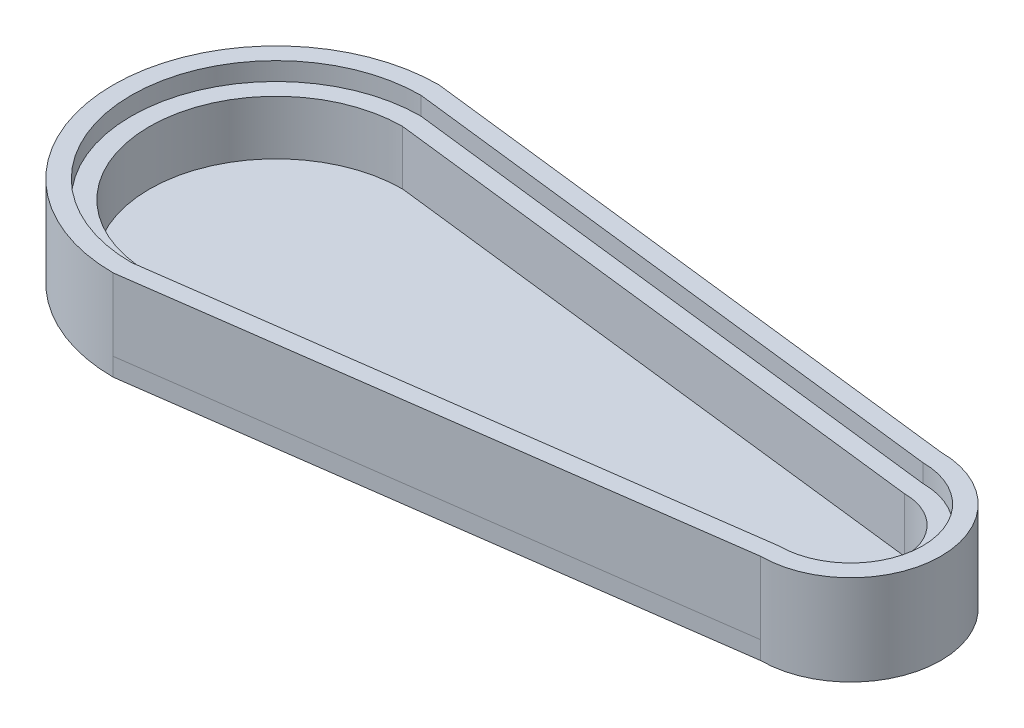
ISO-10303-21;
HEADER;
FILE_DESCRIPTION(('STEP AP214'),'2;1');
FILE_NAME('part.step','',(''),(''),'','','');
FILE_SCHEMA(('AUTOMOTIVE_DESIGN { 1 0 10303 214 1 1 1 1 }'));
ENDSEC;
DATA;
#1=APPLICATION_CONTEXT('core data for automotive mechanical design processes');
#2=APPLICATION_PROTOCOL_DEFINITION('international standard','automotive_design',2000,#1);
#3=PRODUCT_CONTEXT('',#1,'mechanical');
#4=PRODUCT('Part','Part','',(#3));
#5=PRODUCT_RELATED_PRODUCT_CATEGORY('part','',(#4));
#6=PRODUCT_DEFINITION_FORMATION('','',#4);
#7=PRODUCT_DEFINITION_CONTEXT('part definition',#1,'design');
#8=PRODUCT_DEFINITION('design','',#6,#7);
#9=PRODUCT_DEFINITION_SHAPE('','',#8);
#10=(LENGTH_UNIT() NAMED_UNIT(*) SI_UNIT(.MILLI.,.METRE.));
#11=(NAMED_UNIT(*) PLANE_ANGLE_UNIT() SI_UNIT($,.RADIAN.));
#12=(NAMED_UNIT(*) SI_UNIT($,.STERADIAN.) SOLID_ANGLE_UNIT());
#13=UNCERTAINTY_MEASURE_WITH_UNIT(LENGTH_MEASURE(1.E-05),#10,'distance_accuracy_value','');
#14=(GEOMETRIC_REPRESENTATION_CONTEXT(3) GLOBAL_UNCERTAINTY_ASSIGNED_CONTEXT((#13)) GLOBAL_UNIT_ASSIGNED_CONTEXT((#10,
#11,#12)) REPRESENTATION_CONTEXT('',''));
#15=CARTESIAN_POINT('',(0.,0.,0.));
#16=DIRECTION('',(0.,0.,1.));
#17=DIRECTION('',(1.,0.,0.));
#18=AXIS2_PLACEMENT_3D('',#15,#16,#17);
#19=CARTESIAN_POINT('',(0.,31.75,0.));
#20=DIRECTION('',(0.,1.,0.));
#21=DIRECTION('',(0.,0.,1.));
#22=AXIS2_PLACEMENT_3D('',#19,#20,#21);
#23=PLANE('',#22);
#24=CARTESIAN_POINT('',(0.,31.75,0.));
#25=DIRECTION('',(0.,1.,0.));
#26=DIRECTION('',(0.,0.,1.));
#27=AXIS2_PLACEMENT_3D('',#24,#25,#26);
#28=CIRCLE('',#27,57.2426593508019);
#29=CARTESIAN_POINT('',(0.000313664747946366,31.75,-57.2426593499425));
#30=VERTEX_POINT('',#29);
#31=CARTESIAN_POINT('',(-0.0015222865808856,31.75,57.2426593305604));
#32=VERTEX_POINT('',#31);
#33=EDGE_CURVE('E228',#30,#32,#28,.T.);
#34=ORIENTED_EDGE('',*,*,#33,.T.);
#35=DIRECTION('',(0.990671931885279,0.,-0.136268570751621));
#36=VECTOR('',#35,1.);
#37=CARTESIAN_POINT('',(-0.0015222865808856,31.75,57.2426593305604));
#38=LINE('',#37,#36);
#39=CARTESIAN_POINT('',(199.999555895984,31.75,29.7321786199013));
#40=VERTEX_POINT('',#39);
#41=EDGE_CURVE('E232',#32,#40,#38,.T.);
#42=ORIENTED_EDGE('',*,*,#41,.T.);
#43=CARTESIAN_POINT('',(199.999555895984,31.75,-1.96048073028239));
#44=DIRECTION('',(0.,1.,0.));
#45=DIRECTION('',(0.,0.,1.));
#46=AXIS2_PLACEMENT_3D('',#43,#44,#45);
#47=CIRCLE('',#46,31.6926593501836);
#48=CARTESIAN_POINT('',(199.999794405974,31.75,-33.6531400795686));
#49=VERTEX_POINT('',#48);
#50=EDGE_CURVE('E235',#40,#49,#47,.T.);
#51=ORIENTED_EDGE('',*,*,#50,.T.);
#52=DIRECTION('',(-0.993115890729855,0.,-0.117135936329746));
#53=VECTOR('',#52,1.);
#54=CARTESIAN_POINT('',(0.000313664747946366,31.75,-57.2426593499425));
#55=LINE('',#54,#53);
#56=EDGE_CURVE('E239',#49,#30,#55,.T.);
#57=ORIENTED_EDGE('',*,*,#56,.T.);
#58=EDGE_LOOP('',(#34,#42,#51,#57));
#59=FACE_BOUND('',#58,.T.);
#60=CARTESIAN_POINT('',(0.,31.75,0.));
#61=DIRECTION('',(0.,1.,0.));
#62=DIRECTION('',(0.,0.,1.));
#63=AXIS2_PLACEMENT_3D('',#60,#61,#62);
#64=CIRCLE('',#63,50.9);
#65=CARTESIAN_POINT('',(0.,31.75,-50.9));
#66=VERTEX_POINT('',#65);
#67=CARTESIAN_POINT('',(0.,31.75,50.9));
#68=VERTEX_POINT('',#67);
#69=EDGE_CURVE('E150',#66,#68,#64,.T.);
#70=ORIENTED_EDGE('',*,*,#69,.F.);
#71=DIRECTION('',(0.993110118229267,0.,0.117184867071866));
#72=VECTOR('',#71,1.);
#73=CARTESIAN_POINT('',(0.,31.75,-50.9));
#74=LINE('',#73,#72);
#75=CARTESIAN_POINT('',(199.999555895984,31.75,-27.3004807302824));
#76=VERTEX_POINT('',#75);
#77=EDGE_CURVE('E61',#66,#76,#74,.T.);
#78=ORIENTED_EDGE('',*,*,#77,.T.);
#79=CARTESIAN_POINT('',(199.999555895984,31.75,-1.96048073028239));
#80=DIRECTION('',(0.,1.,0.));
#81=DIRECTION('',(0.,0.,1.));
#82=AXIS2_PLACEMENT_3D('',#79,#80,#81);
#83=CIRCLE('',#82,25.34);
#84=CARTESIAN_POINT('',(199.999555895984,31.75,23.3795192697176));
#85=VERTEX_POINT('',#84);
#86=EDGE_CURVE('E157',#85,#76,#83,.T.);
#87=ORIENTED_EDGE('',*,*,#86,.F.);
#88=DIRECTION('',(0.990665103732435,0.,-0.136318202184464));
#89=VECTOR('',#88,1.);
#90=CARTESIAN_POINT('',(0.,31.75,50.9));
#91=LINE('',#90,#89);
#92=EDGE_CURVE('E177',#68,#85,#91,.T.);
#93=ORIENTED_EDGE('',*,*,#92,.F.);
#94=EDGE_LOOP('',(#70,#78,#87,#93));
#95=FACE_BOUND('',#94,.T.);
#96=ADVANCED_FACE('F45',(#59,#95),#23,.T.);
#97=CARTESIAN_POINT('',(0.,6.35,0.));
#98=DIRECTION('',(0.,-1.,0.));
#99=DIRECTION('',(0.,0.,-1.));
#100=AXIS2_PLACEMENT_3D('',#97,#98,#99);
#101=CYLINDRICAL_SURFACE('',#100,57.2426593508019);
#102=CARTESIAN_POINT('',(0.,0.,0.));
#103=DIRECTION('',(0.,-1.,0.));
#104=DIRECTION('',(0.,0.,-1.));
#105=AXIS2_PLACEMENT_3D('',#102,#103,#104);
#106=CIRCLE('',#105,57.2426593508019);
#107=CARTESIAN_POINT('',(-0.0015222865808583,0.,57.2426593305604));
#108=VERTEX_POINT('',#107);
#109=CARTESIAN_POINT('',(0.000313664747946366,0.,-57.2426593499425));
#110=VERTEX_POINT('',#109);
#111=EDGE_CURVE('E325',#108,#110,#106,.T.);
#112=ORIENTED_EDGE('',*,*,#111,.F.);
#113=DIRECTION('',(0.,-1.,0.));
#114=VECTOR('',#113,1.);
#115=CARTESIAN_POINT('',(-0.0015222865808583,6.35,57.2426593305604));
#116=LINE('',#115,#114);
#117=CARTESIAN_POINT('',(-0.0015222865808856,6.35,57.2426593305604));
#118=VERTEX_POINT('',#117);
#119=EDGE_CURVE('E54',#118,#108,#116,.T.);
#120=ORIENTED_EDGE('',*,*,#119,.F.);
#121=DIRECTION('',(0.,-1.,0.));
#122=VECTOR('',#121,1.);
#123=CARTESIAN_POINT('',(-0.0015222865808856,31.75,57.2426593305604));
#124=LINE('',#123,#122);
#125=EDGE_CURVE('E254',#32,#118,#124,.T.);
#126=ORIENTED_EDGE('',*,*,#125,.F.);
#127=ORIENTED_EDGE('',*,*,#33,.F.);
#128=DIRECTION('',(0.,-1.,0.));
#129=VECTOR('',#128,1.);
#130=CARTESIAN_POINT('',(0.000313664747946366,6.35,-57.2426593499425));
#131=LINE('',#130,#129);
#132=EDGE_CURVE('E308',#30,#110,#131,.T.);
#133=ORIENTED_EDGE('',*,*,#132,.T.);
#134=EDGE_LOOP('',(#112,#120,#126,#127,#133));
#135=FACE_BOUND('',#134,.T.);
#136=ADVANCED_FACE('F47',(#135),#101,.T.);
#137=CARTESIAN_POINT('',(-0.0015222865808583,6.35,57.2426593305604));
#138=DIRECTION('',(-0.136268730244773,0.,-0.990671909946717));
#139=DIRECTION('',(-0.990671909946718,0.,0.136268730244773));
#140=AXIS2_PLACEMENT_3D('',#137,#138,#139);
#141=PLANE('',#140);
#142=DIRECTION('',(0.990671909946718,0.,-0.136268730244773));
#143=VECTOR('',#142,1.);
#144=CARTESIAN_POINT('',(-0.0015222865808583,0.,57.2426593305604));
#145=LINE('',#144,#143);
#146=CARTESIAN_POINT('',(199.999317385994,0.,29.7321786190038));
#147=VERTEX_POINT('',#146);
#148=EDGE_CURVE('E315',#108,#147,#145,.T.);
#149=ORIENTED_EDGE('',*,*,#148,.T.);
#150=DIRECTION('',(0.,-1.,0.));
#151=VECTOR('',#150,1.);
#152=CARTESIAN_POINT('',(199.999317385994,6.35,29.7321786190038));
#153=LINE('',#152,#151);
#154=CARTESIAN_POINT('',(199.999436640989,6.35,29.7321786194525));
#155=VERTEX_POINT('',#154);
#156=EDGE_CURVE('E296',#155,#147,#153,.T.);
#157=ORIENTED_EDGE('',*,*,#156,.F.);
#158=CARTESIAN_POINT('',(-0.0015222865808856,6.35,57.2426593305604));
#159=DIRECTION('',(0.990671931885279,0.,-0.136268570751621));
#160=VECTOR('',#159,1.);
#161=LINE('',#158,#160);
#162=EDGE_CURVE('E248',#118,#155,#161,.T.);
#163=ORIENTED_EDGE('',*,*,#162,.F.);
#164=ORIENTED_EDGE('',*,*,#119,.T.);
#165=EDGE_LOOP('',(#149,#157,#163,#164));
#166=FACE_BOUND('',#165,.T.);
#167=ADVANCED_FACE('F277',(#166),#141,.F.);
#168=CARTESIAN_POINT('',(199.999555895984,6.35,-1.96048073028239));
#169=DIRECTION('',(0.,-1.,0.));
#170=DIRECTION('',(0.,0.,-1.));
#171=AXIS2_PLACEMENT_3D('',#168,#169,#170);
#172=CYLINDRICAL_SURFACE('',#171,31.6926593501836);
#173=CARTESIAN_POINT('',(199.999555895984,0.,-1.96048073028239));
#174=DIRECTION('',(0.,1.,0.));
#175=DIRECTION('',(0.,0.,1.));
#176=AXIS2_PLACEMENT_3D('',#173,#174,#175);
#177=CIRCLE('',#176,31.6926593501836);
#178=CARTESIAN_POINT('',(199.999794405974,0.,-33.6531400795686));
#179=VERTEX_POINT('',#178);
#180=EDGE_CURVE('E318',#147,#179,#177,.T.);
#181=ORIENTED_EDGE('',*,*,#180,.T.);
#182=DIRECTION('',(0.,-1.,0.));
#183=VECTOR('',#182,1.);
#184=CARTESIAN_POINT('',(199.999794405974,6.35,-33.6531400795686));
#185=LINE('',#184,#183);
#186=EDGE_CURVE('E301',#49,#179,#185,.T.);
#187=ORIENTED_EDGE('',*,*,#186,.F.);
#188=ORIENTED_EDGE('',*,*,#50,.F.);
#189=DIRECTION('',(0.,-1.,0.));
#190=VECTOR('',#189,1.);
#191=CARTESIAN_POINT('',(199.999555895984,31.75,29.7321786199013));
#192=LINE('',#191,#190);
#193=EDGE_CURVE('E243',#40,#155,#192,.T.);
#194=ORIENTED_EDGE('',*,*,#193,.T.);
#195=ORIENTED_EDGE('',*,*,#156,.T.);
#196=EDGE_LOOP('',(#181,#187,#188,#194,#195));
#197=FACE_BOUND('',#196,.T.);
#198=ADVANCED_FACE('F281',(#197),#172,.T.);
#199=CARTESIAN_POINT('',(0.000313664747946366,6.35,-57.2426593499425));
#200=DIRECTION('',(0.117135936329746,0.,-0.993115890729855));
#201=DIRECTION('',(-0.993115890729855,0.,-0.117135936329746));
#202=AXIS2_PLACEMENT_3D('',#199,#200,#201);
#203=PLANE('',#202);
#204=DIRECTION('',(0.993115890729855,0.,0.117135936329746));
#205=VECTOR('',#204,1.);
#206=CARTESIAN_POINT('',(0.000313664747946366,0.,-57.2426593499425));
#207=LINE('',#206,#205);
#208=EDGE_CURVE('E321',#110,#179,#207,.T.);
#209=ORIENTED_EDGE('',*,*,#208,.F.);
#210=ORIENTED_EDGE('',*,*,#132,.F.);
#211=ORIENTED_EDGE('',*,*,#56,.F.);
#212=ORIENTED_EDGE('',*,*,#186,.T.);
#213=EDGE_LOOP('',(#209,#210,#211,#212));
#214=FACE_BOUND('',#213,.T.);
#215=ADVANCED_FACE('F275',(#214),#203,.T.);
#216=CARTESIAN_POINT('',(0.,0.,0.));
#217=DIRECTION('',(0.,-1.,0.));
#218=DIRECTION('',(0.,0.,-1.));
#219=AXIS2_PLACEMENT_3D('',#216,#217,#218);
#220=PLANE('',#219);
#221=ORIENTED_EDGE('',*,*,#111,.T.);
#222=ORIENTED_EDGE('',*,*,#208,.T.);
#223=ORIENTED_EDGE('',*,*,#180,.F.);
#224=ORIENTED_EDGE('',*,*,#148,.F.);
#225=EDGE_LOOP('',(#221,#222,#223,#224));
#226=FACE_BOUND('',#225,.T.);
#227=ADVANCED_FACE('F266',(#226),#220,.T.);
#228=CARTESIAN_POINT('',(-0.0015222865808856,31.75,57.2426593305604));
#229=DIRECTION('',(-0.136268570751621,0.,-0.990671931885279));
#230=DIRECTION('',(-0.990671931885279,0.,0.136268570751621));
#231=AXIS2_PLACEMENT_3D('',#228,#229,#230);
#232=PLANE('',#231);
#233=ORIENTED_EDGE('',*,*,#162,.T.);
#234=ORIENTED_EDGE('',*,*,#193,.F.);
#235=ORIENTED_EDGE('',*,*,#41,.F.);
#236=ORIENTED_EDGE('',*,*,#125,.T.);
#237=EDGE_LOOP('',(#233,#234,#235,#236));
#238=FACE_BOUND('',#237,.T.);
#239=ADVANCED_FACE('F256',(#238),#232,.F.);
#240=CARTESIAN_POINT('',(0.,25.4,-50.9));
#241=DIRECTION('',(-0.117184867071866,0.,0.993110118229267));
#242=DIRECTION('',(0.993110118229267,0.,0.117184867071866));
#243=AXIS2_PLACEMENT_3D('',#240,#241,#242);
#244=PLANE('',#243);
#245=ORIENTED_EDGE('',*,*,#77,.F.);
#246=DIRECTION('',(0.,1.,0.));
#247=VECTOR('',#246,1.);
#248=CARTESIAN_POINT('',(0.,25.4,-50.9));
#249=LINE('',#248,#247);
#250=CARTESIAN_POINT('',(0.,25.4,-50.9));
#251=VERTEX_POINT('',#250);
#252=EDGE_CURVE('E143',#251,#66,#249,.T.);
#253=ORIENTED_EDGE('',*,*,#252,.F.);
#254=DIRECTION('',(0.993110118229267,0.,0.117184867071866));
#255=VECTOR('',#254,1.);
#256=CARTESIAN_POINT('',(0.,25.4,-50.9));
#257=LINE('',#256,#255);
#258=CARTESIAN_POINT('',(199.999555895984,25.4,-27.3004807302824));
#259=VERTEX_POINT('',#258);
#260=EDGE_CURVE('E138',#251,#259,#257,.T.);
#261=ORIENTED_EDGE('',*,*,#260,.T.);
#262=DIRECTION('',(0.,1.,0.));
#263=VECTOR('',#262,1.);
#264=CARTESIAN_POINT('',(199.999555895984,25.4,-27.3004807302824));
#265=LINE('',#264,#263);
#266=EDGE_CURVE('E141',#259,#76,#265,.T.);
#267=ORIENTED_EDGE('',*,*,#266,.T.);
#268=EDGE_LOOP('',(#245,#253,#261,#267));
#269=FACE_BOUND('',#268,.T.);
#270=ADVANCED_FACE('F140',(#269),#244,.T.);
#271=CARTESIAN_POINT('',(199.999555895984,25.4,-1.96048073028239));
#272=DIRECTION('',(0.,1.,0.));
#273=DIRECTION('',(0.,0.,1.));
#274=AXIS2_PLACEMENT_3D('',#271,#272,#273);
#275=CYLINDRICAL_SURFACE('',#274,25.34);
#276=ORIENTED_EDGE('',*,*,#86,.T.);
#277=ORIENTED_EDGE('',*,*,#266,.F.);
#278=CARTESIAN_POINT('',(199.999555895984,25.4,-1.96048073028239));
#279=DIRECTION('',(0.,1.,0.));
#280=DIRECTION('',(0.,0.,1.));
#281=AXIS2_PLACEMENT_3D('',#278,#279,#280);
#282=CIRCLE('',#281,25.34);
#283=CARTESIAN_POINT('',(199.999555895984,25.4,23.3795192697176));
#284=VERTEX_POINT('',#283);
#285=EDGE_CURVE('E149',#284,#259,#282,.T.);
#286=ORIENTED_EDGE('',*,*,#285,.F.);
#287=DIRECTION('',(0.,1.,0.));
#288=VECTOR('',#287,1.);
#289=CARTESIAN_POINT('',(199.999555895984,25.4,23.3795192697176));
#290=LINE('',#289,#288);
#291=EDGE_CURVE('E160',#284,#85,#290,.T.);
#292=ORIENTED_EDGE('',*,*,#291,.T.);
#293=EDGE_LOOP('',(#276,#277,#286,#292));
#294=FACE_BOUND('',#293,.T.);
#295=ADVANCED_FACE('F154',(#294),#275,.F.);
#296=CARTESIAN_POINT('',(0.,25.4,50.9));
#297=DIRECTION('',(0.136318202184464,0.,0.990665103732435));
#298=DIRECTION('',(0.990665103732435,0.,-0.136318202184464));
#299=AXIS2_PLACEMENT_3D('',#296,#297,#298);
#300=PLANE('',#299);
#301=ORIENTED_EDGE('',*,*,#92,.T.);
#302=ORIENTED_EDGE('',*,*,#291,.F.);
#303=DIRECTION('',(0.990665103732435,0.,-0.136318202184464));
#304=VECTOR('',#303,1.);
#305=CARTESIAN_POINT('',(0.,25.4,50.9));
#306=LINE('',#305,#304);
#307=CARTESIAN_POINT('',(0.,25.4,50.9));
#308=VERTEX_POINT('',#307);
#309=EDGE_CURVE('E164',#308,#284,#306,.T.);
#310=ORIENTED_EDGE('',*,*,#309,.F.);
#311=DIRECTION('',(0.,1.,0.));
#312=VECTOR('',#311,1.);
#313=CARTESIAN_POINT('',(0.,25.4,50.9));
#314=LINE('',#313,#312);
#315=EDGE_CURVE('E186',#308,#68,#314,.T.);
#316=ORIENTED_EDGE('',*,*,#315,.T.);
#317=EDGE_LOOP('',(#301,#302,#310,#316));
#318=FACE_BOUND('',#317,.T.);
#319=ADVANCED_FACE('F410',(#318),#300,.F.);
#320=CARTESIAN_POINT('',(0.,25.4,0.));
#321=DIRECTION('',(0.,1.,0.));
#322=DIRECTION('',(0.,0.,1.));
#323=AXIS2_PLACEMENT_3D('',#320,#321,#322);
#324=CYLINDRICAL_SURFACE('',#323,50.9);
#325=ORIENTED_EDGE('',*,*,#69,.T.);
#326=ORIENTED_EDGE('',*,*,#315,.F.);
#327=CARTESIAN_POINT('',(0.,25.4,0.));
#328=DIRECTION('',(0.,1.,0.));
#329=DIRECTION('',(0.,0.,1.));
#330=AXIS2_PLACEMENT_3D('',#327,#328,#329);
#331=CIRCLE('',#330,50.9);
#332=EDGE_CURVE('E168',#251,#308,#331,.T.);
#333=ORIENTED_EDGE('',*,*,#332,.F.);
#334=ORIENTED_EDGE('',*,*,#252,.T.);
#335=EDGE_LOOP('',(#325,#326,#333,#334));
#336=FACE_BOUND('',#335,.T.);
#337=ADVANCED_FACE('F420',(#336),#324,.F.);
#338=CARTESIAN_POINT('',(199.999555895984,25.4,-1.96048073028239));
#339=DIRECTION('',(0.,1.,0.));
#340=DIRECTION('',(0.,0.,1.));
#341=AXIS2_PLACEMENT_3D('',#338,#339,#340);
#342=PLANE('',#341);
#343=DIRECTION('',(-0.993110118229267,0.,-0.117184867071866));
#344=VECTOR('',#343,1.);
#345=CARTESIAN_POINT('',(-0.106213449918624,25.4,-44.55));
#346=LINE('',#345,#344);
#347=CARTESIAN_POINT('',(199.893342446065,25.4,-20.9504807302824));
#348=VERTEX_POINT('',#347);
#349=CARTESIAN_POINT('',(-0.106213449918624,25.4,-44.55));
#350=VERTEX_POINT('',#349);
#351=EDGE_CURVE('E11',#348,#350,#346,.T.);
#352=ORIENTED_EDGE('',*,*,#351,.F.);
#353=CARTESIAN_POINT('',(199.999555895984,25.4,-1.96048073028239));
#354=DIRECTION('',(0.,1.,0.));
#355=DIRECTION('',(0.,0.,1.));
#356=AXIS2_PLACEMENT_3D('',#353,#354,#355);
#357=CIRCLE('',#356,18.9902970302453);
#358=CARTESIAN_POINT('',(199.893342446065,25.4,17.0295192697176));
#359=VERTEX_POINT('',#358);
#360=EDGE_CURVE('E159',#359,#348,#357,.T.);
#361=ORIENTED_EDGE('',*,*,#360,.F.);
#362=DIRECTION('',(0.990665103732435,0.,-0.136318202184464));
#363=VECTOR('',#362,1.);
#364=CARTESIAN_POINT('',(-0.106213449918632,25.4,44.55));
#365=LINE('',#364,#363);
#366=CARTESIAN_POINT('',(-0.106213449918632,25.4,44.55));
#367=VERTEX_POINT('',#366);
#368=EDGE_CURVE('E194',#367,#359,#365,.T.);
#369=ORIENTED_EDGE('',*,*,#368,.F.);
#370=CARTESIAN_POINT('',(0.,25.4,0.));
#371=DIRECTION('',(0.,1.,0.));
#372=DIRECTION('',(0.,0.,1.));
#373=AXIS2_PLACEMENT_3D('',#370,#371,#372);
#374=CIRCLE('',#373,44.5501266137027);
#375=EDGE_CURVE('E69',#350,#367,#374,.T.);
#376=ORIENTED_EDGE('',*,*,#375,.F.);
#377=EDGE_LOOP('',(#352,#361,#369,#376));
#378=FACE_BOUND('',#377,.T.);
#379=ORIENTED_EDGE('',*,*,#260,.F.);
#380=ORIENTED_EDGE('',*,*,#332,.T.);
#381=ORIENTED_EDGE('',*,*,#309,.T.);
#382=ORIENTED_EDGE('',*,*,#285,.T.);
#383=EDGE_LOOP('',(#379,#380,#381,#382));
#384=FACE_BOUND('',#383,.T.);
#385=ADVANCED_FACE('F162',(#378,#384),#342,.T.);
#386=CARTESIAN_POINT('',(0.,6.35,0.));
#387=DIRECTION('',(0.,-1.,0.));
#388=DIRECTION('',(0.,0.,-1.));
#389=AXIS2_PLACEMENT_3D('',#386,#387,#388);
#390=PLANE('',#389);
#391=DIRECTION('',(-0.993110118229267,0.,-0.117184867071866));
#392=VECTOR('',#391,1.);
#393=CARTESIAN_POINT('',(-0.106213449918624,6.35,-44.55));
#394=LINE('',#393,#392);
#395=CARTESIAN_POINT('',(199.893342446065,6.35,-20.9504807302824));
#396=VERTEX_POINT('',#395);
#397=CARTESIAN_POINT('',(-0.106213449918624,6.35,-44.55));
#398=VERTEX_POINT('',#397);
#399=EDGE_CURVE('E212',#396,#398,#394,.T.);
#400=ORIENTED_EDGE('',*,*,#399,.T.);
#401=CARTESIAN_POINT('',(0.,6.35,0.));
#402=DIRECTION('',(0.,1.,0.));
#403=DIRECTION('',(0.,0.,1.));
#404=AXIS2_PLACEMENT_3D('',#401,#402,#403);
#405=CIRCLE('',#404,44.5501266137027);
#406=CARTESIAN_POINT('',(-0.106213449918632,6.35,44.55));
#407=VERTEX_POINT('',#406);
#408=EDGE_CURVE('E200',#398,#407,#405,.T.);
#409=ORIENTED_EDGE('',*,*,#408,.T.);
#410=DIRECTION('',(0.990665103732435,0.,-0.136318202184464));
#411=VECTOR('',#410,1.);
#412=CARTESIAN_POINT('',(-0.106213449918632,6.35,44.55));
#413=LINE('',#412,#411);
#414=CARTESIAN_POINT('',(199.893342446065,6.35,17.0295192697176));
#415=VERTEX_POINT('',#414);
#416=EDGE_CURVE('E204',#407,#415,#413,.T.);
#417=ORIENTED_EDGE('',*,*,#416,.T.);
#418=CARTESIAN_POINT('',(199.999555895984,6.35,-1.96048073028239));
#419=DIRECTION('',(0.,1.,0.));
#420=DIRECTION('',(0.,0.,-1.));
#421=AXIS2_PLACEMENT_3D('',#418,#419,#420);
#422=CIRCLE('',#421,18.9902970302453);
#423=EDGE_CURVE('E208',#415,#396,#422,.T.);
#424=ORIENTED_EDGE('',*,*,#423,.T.);
#425=EDGE_LOOP('',(#400,#409,#417,#424));
#426=FACE_BOUND('',#425,.T.);
#427=ADVANCED_FACE('F268',(#426),#390,.F.);
#428=CARTESIAN_POINT('',(-0.106213449918624,31.75,-44.55));
#429=DIRECTION('',(-0.117184867071866,0.,0.993110118229267));
#430=DIRECTION('',(0.993110118229267,0.,0.117184867071866));
#431=AXIS2_PLACEMENT_3D('',#428,#429,#430);
#432=PLANE('',#431);
#433=DIRECTION('',(0.,-1.,0.));
#434=VECTOR('',#433,1.);
#435=CARTESIAN_POINT('',(199.893342446065,31.75,-20.9504807302824));
#436=LINE('',#435,#434);
#437=EDGE_CURVE('E219',#348,#396,#436,.T.);
#438=ORIENTED_EDGE('',*,*,#437,.F.);
#439=ORIENTED_EDGE('',*,*,#351,.T.);
#440=DIRECTION('',(0.,-1.,0.));
#441=VECTOR('',#440,1.);
#442=CARTESIAN_POINT('',(-0.106213449918624,31.75,-44.55));
#443=LINE('',#442,#441);
#444=EDGE_CURVE('E216',#350,#398,#443,.T.);
#445=ORIENTED_EDGE('',*,*,#444,.T.);
#446=ORIENTED_EDGE('',*,*,#399,.F.);
#447=EDGE_LOOP('',(#438,#439,#445,#446));
#448=FACE_BOUND('',#447,.T.);
#449=ADVANCED_FACE('F271',(#448),#432,.T.);
#450=CARTESIAN_POINT('',(199.999555895984,31.75,-1.96048073028239));
#451=DIRECTION('',(0.,-1.,0.));
#452=DIRECTION('',(0.,0.,-1.));
#453=AXIS2_PLACEMENT_3D('',#450,#451,#452);
#454=CYLINDRICAL_SURFACE('',#453,18.9902970302453);
#455=DIRECTION('',(0.,-1.,0.));
#456=VECTOR('',#455,1.);
#457=CARTESIAN_POINT('',(199.893342446065,31.75,17.0295192697176));
#458=LINE('',#457,#456);
#459=EDGE_CURVE('E222',#359,#415,#458,.T.);
#460=ORIENTED_EDGE('',*,*,#459,.F.);
#461=ORIENTED_EDGE('',*,*,#360,.T.);
#462=ORIENTED_EDGE('',*,*,#437,.T.);
#463=ORIENTED_EDGE('',*,*,#423,.F.);
#464=EDGE_LOOP('',(#460,#461,#462,#463));
#465=FACE_BOUND('',#464,.T.);
#466=ADVANCED_FACE('F448',(#465),#454,.F.);
#467=CARTESIAN_POINT('',(-0.106213449918632,31.75,44.55));
#468=DIRECTION('',(-0.136318202184464,0.,-0.990665103732435));
#469=DIRECTION('',(-0.990665103732435,0.,0.136318202184464));
#470=AXIS2_PLACEMENT_3D('',#467,#468,#469);
#471=PLANE('',#470);
#472=DIRECTION('',(0.,-1.,0.));
#473=VECTOR('',#472,1.);
#474=CARTESIAN_POINT('',(-0.106213449918632,31.75,44.55));
#475=LINE('',#474,#473);
#476=EDGE_CURVE('E225',#367,#407,#475,.T.);
#477=ORIENTED_EDGE('',*,*,#476,.F.);
#478=ORIENTED_EDGE('',*,*,#368,.T.);
#479=ORIENTED_EDGE('',*,*,#459,.T.);
#480=ORIENTED_EDGE('',*,*,#416,.F.);
#481=EDGE_LOOP('',(#477,#478,#479,#480));
#482=FACE_BOUND('',#481,.T.);
#483=ADVANCED_FACE('F457',(#482),#471,.T.);
#484=CARTESIAN_POINT('',(0.,31.75,0.));
#485=DIRECTION('',(0.,-1.,0.));
#486=DIRECTION('',(0.,0.,-1.));
#487=AXIS2_PLACEMENT_3D('',#484,#485,#486);
#488=CYLINDRICAL_SURFACE('',#487,44.5501266137027);
#489=ORIENTED_EDGE('',*,*,#444,.F.);
#490=ORIENTED_EDGE('',*,*,#375,.T.);
#491=ORIENTED_EDGE('',*,*,#476,.T.);
#492=ORIENTED_EDGE('',*,*,#408,.F.);
#493=EDGE_LOOP('',(#489,#490,#491,#492));
#494=FACE_BOUND('',#493,.T.);
#495=ADVANCED_FACE('F467',(#494),#488,.F.);
#496=CLOSED_SHELL('',(#96,#136,#167,#198,#215,#227,#239,#270,#295,#319,#337,#385,#427,#449,#466,
#483,#495));
#497=MANIFOLD_SOLID_BREP('B2',#496);
#498=ADVANCED_BREP_SHAPE_REPRESENTATION('',(#18,#497),#14);
#499=SHAPE_DEFINITION_REPRESENTATION(#9,#498);
ENDSEC;
END-ISO-10303-21;
